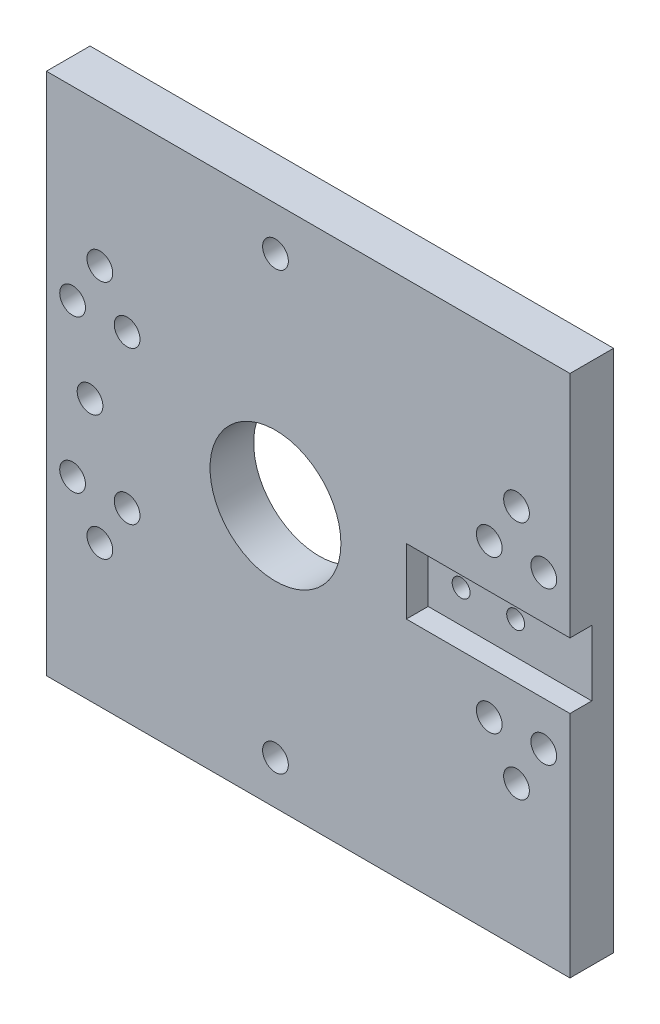
ISO-10303-21;
HEADER;
FILE_DESCRIPTION(('STEP AP214'),'2;1');
FILE_NAME('part.step','',(''),(''),'','','');
FILE_SCHEMA(('AUTOMOTIVE_DESIGN { 1 0 10303 214 1 1 1 1 }'));
ENDSEC;
DATA;
#1=APPLICATION_CONTEXT('core data for automotive mechanical design processes');
#2=APPLICATION_PROTOCOL_DEFINITION('international standard','automotive_design',2000,#1);
#3=PRODUCT_CONTEXT('',#1,'mechanical');
#4=PRODUCT('Part','Part','',(#3));
#5=PRODUCT_RELATED_PRODUCT_CATEGORY('part','',(#4));
#6=PRODUCT_DEFINITION_FORMATION('','',#4);
#7=PRODUCT_DEFINITION_CONTEXT('part definition',#1,'design');
#8=PRODUCT_DEFINITION('design','',#6,#7);
#9=PRODUCT_DEFINITION_SHAPE('','',#8);
#10=(LENGTH_UNIT() NAMED_UNIT(*) SI_UNIT(.MILLI.,.METRE.));
#11=(NAMED_UNIT(*) PLANE_ANGLE_UNIT() SI_UNIT($,.RADIAN.));
#12=(NAMED_UNIT(*) SI_UNIT($,.STERADIAN.) SOLID_ANGLE_UNIT());
#13=UNCERTAINTY_MEASURE_WITH_UNIT(LENGTH_MEASURE(1.E-05),#10,'distance_accuracy_value','');
#14=(GEOMETRIC_REPRESENTATION_CONTEXT(3) GLOBAL_UNCERTAINTY_ASSIGNED_CONTEXT((#13)) GLOBAL_UNIT_ASSIGNED_CONTEXT((#10,
#11,#12)) REPRESENTATION_CONTEXT('',''));
#15=CARTESIAN_POINT('',(0.,0.,0.));
#16=DIRECTION('',(0.,0.,1.));
#17=DIRECTION('',(1.,0.,0.));
#18=AXIS2_PLACEMENT_3D('',#15,#16,#17);
#19=CARTESIAN_POINT('',(67.5,0.,5.));
#20=DIRECTION('',(1.,0.,0.));
#21=DIRECTION('',(0.,0.,-1.));
#22=AXIS2_PLACEMENT_3D('',#19,#20,#21);
#23=PLANE('',#22);
#24=DIRECTION('',(0.,0.,-1.));
#25=VECTOR('',#24,1.);
#26=CARTESIAN_POINT('',(67.5,-60.,5.));
#27=LINE('',#26,#25);
#28=CARTESIAN_POINT('',(67.5,-60.,10.));
#29=VERTEX_POINT('',#28);
#30=CARTESIAN_POINT('',(67.5,-60.,0.));
#31=VERTEX_POINT('',#30);
#32=EDGE_CURVE('E157',#29,#31,#27,.T.);
#33=ORIENTED_EDGE('',*,*,#32,.T.);
#34=DIRECTION('',(0.,-1.,0.));
#35=VECTOR('',#34,1.);
#36=CARTESIAN_POINT('',(67.5,0.,0.));
#37=LINE('',#36,#35);
#38=CARTESIAN_POINT('',(67.5,60.,0.));
#39=VERTEX_POINT('',#38);
#40=EDGE_CURVE('E54',#39,#31,#37,.T.);
#41=ORIENTED_EDGE('',*,*,#40,.F.);
#42=DIRECTION('',(0.,0.,-1.));
#43=VECTOR('',#42,1.);
#44=CARTESIAN_POINT('',(67.5,60.,5.));
#45=LINE('',#44,#43);
#46=CARTESIAN_POINT('',(67.5,60.,10.));
#47=VERTEX_POINT('',#46);
#48=EDGE_CURVE('E12',#47,#39,#45,.T.);
#49=ORIENTED_EDGE('',*,*,#48,.F.);
#50=DIRECTION('',(0.,-1.,0.));
#51=VECTOR('',#50,1.);
#52=CARTESIAN_POINT('',(67.5,0.,10.));
#53=LINE('',#52,#51);
#54=CARTESIAN_POINT('',(67.5,7.5,10.));
#55=VERTEX_POINT('',#54);
#56=EDGE_CURVE('E106',#47,#55,#53,.T.);
#57=ORIENTED_EDGE('',*,*,#56,.T.);
#58=DIRECTION('',(0.,0.,-1.));
#59=VECTOR('',#58,1.);
#60=CARTESIAN_POINT('',(67.5,7.5,184.705627484771));
#61=LINE('',#60,#59);
#62=CARTESIAN_POINT('',(67.5,7.5,5.));
#63=VERTEX_POINT('',#62);
#64=EDGE_CURVE('E127',#55,#63,#61,.T.);
#65=ORIENTED_EDGE('',*,*,#64,.T.);
#66=DIRECTION('',(0.,-1.,0.));
#67=VECTOR('',#66,1.);
#68=CARTESIAN_POINT('',(67.5,0.,5.));
#69=LINE('',#68,#67);
#70=CARTESIAN_POINT('',(67.5,-7.5,5.));
#71=VERTEX_POINT('',#70);
#72=EDGE_CURVE('E147',#63,#71,#69,.T.);
#73=ORIENTED_EDGE('',*,*,#72,.T.);
#74=DIRECTION('',(0.,0.,-1.));
#75=VECTOR('',#74,1.);
#76=CARTESIAN_POINT('',(67.5,-7.5,184.705627484771));
#77=LINE('',#76,#75);
#78=CARTESIAN_POINT('',(67.5,-7.5,10.));
#79=VERTEX_POINT('',#78);
#80=EDGE_CURVE('E120',#79,#71,#77,.T.);
#81=ORIENTED_EDGE('',*,*,#80,.F.);
#82=DIRECTION('',(0.,-1.,0.));
#83=VECTOR('',#82,1.);
#84=CARTESIAN_POINT('',(67.5,0.,10.));
#85=LINE('',#84,#83);
#86=EDGE_CURVE('E183',#79,#29,#85,.T.);
#87=ORIENTED_EDGE('',*,*,#86,.T.);
#88=EDGE_LOOP('',(#33,#41,#49,#57,#65,#73,#81,#87));
#89=FACE_BOUND('',#88,.T.);
#90=ADVANCED_FACE('F40',(#89),#23,.T.);
#91=CARTESIAN_POINT('',(0.,60.,5.));
#92=DIRECTION('',(0.,1.,0.));
#93=DIRECTION('',(0.,0.,1.));
#94=AXIS2_PLACEMENT_3D('',#91,#92,#93);
#95=PLANE('',#94);
#96=DIRECTION('',(1.,0.,0.));
#97=VECTOR('',#96,1.);
#98=CARTESIAN_POINT('',(0.,60.,0.));
#99=LINE('',#98,#97);
#100=CARTESIAN_POINT('',(-52.5,60.,0.));
#101=VERTEX_POINT('',#100);
#102=EDGE_CURVE('E159',#101,#39,#99,.T.);
#103=ORIENTED_EDGE('',*,*,#102,.F.);
#104=DIRECTION('',(0.,0.,-1.));
#105=VECTOR('',#104,1.);
#106=CARTESIAN_POINT('',(-52.5,60.,5.));
#107=LINE('',#106,#105);
#108=CARTESIAN_POINT('',(-52.5,60.,10.));
#109=VERTEX_POINT('',#108);
#110=EDGE_CURVE('E47',#109,#101,#107,.T.);
#111=ORIENTED_EDGE('',*,*,#110,.F.);
#112=DIRECTION('',(1.,0.,0.));
#113=VECTOR('',#112,1.);
#114=CARTESIAN_POINT('',(0.,60.,10.));
#115=LINE('',#114,#113);
#116=EDGE_CURVE('E114',#109,#47,#115,.T.);
#117=ORIENTED_EDGE('',*,*,#116,.T.);
#118=ORIENTED_EDGE('',*,*,#48,.T.);
#119=EDGE_LOOP('',(#103,#111,#117,#118));
#120=FACE_BOUND('',#119,.T.);
#121=ADVANCED_FACE('F122',(#120),#95,.T.);
#122=CARTESIAN_POINT('',(-52.5,0.,5.));
#123=DIRECTION('',(1.,0.,0.));
#124=DIRECTION('',(0.,0.,-1.));
#125=AXIS2_PLACEMENT_3D('',#122,#123,#124);
#126=PLANE('',#125);
#127=DIRECTION('',(0.,-1.,0.));
#128=VECTOR('',#127,1.);
#129=CARTESIAN_POINT('',(-52.5,0.,0.));
#130=LINE('',#129,#128);
#131=CARTESIAN_POINT('',(-52.5,-60.,0.));
#132=VERTEX_POINT('',#131);
#133=EDGE_CURVE('E62',#101,#132,#130,.T.);
#134=ORIENTED_EDGE('',*,*,#133,.T.);
#135=DIRECTION('',(0.,0.,-1.));
#136=VECTOR('',#135,1.);
#137=CARTESIAN_POINT('',(-52.5,-60.,5.));
#138=LINE('',#137,#136);
#139=CARTESIAN_POINT('',(-52.5,-60.,10.));
#140=VERTEX_POINT('',#139);
#141=EDGE_CURVE('E174',#140,#132,#138,.T.);
#142=ORIENTED_EDGE('',*,*,#141,.F.);
#143=DIRECTION('',(0.,-1.,0.));
#144=VECTOR('',#143,1.);
#145=CARTESIAN_POINT('',(-52.5,0.,10.));
#146=LINE('',#145,#144);
#147=EDGE_CURVE('E124',#109,#140,#146,.T.);
#148=ORIENTED_EDGE('',*,*,#147,.F.);
#149=ORIENTED_EDGE('',*,*,#110,.T.);
#150=EDGE_LOOP('',(#134,#142,#148,#149));
#151=FACE_BOUND('',#150,.T.);
#152=ADVANCED_FACE('F175',(#151),#126,.F.);
#153=CARTESIAN_POINT('',(50.05,0.,5.));
#154=DIRECTION('',(0.,0.,-1.));
#155=DIRECTION('',(-1.,0.,0.));
#156=AXIS2_PLACEMENT_3D('',#153,#154,#155);
#157=CYLINDRICAL_SURFACE('',#156,2.04999999999999);
#158=CARTESIAN_POINT('',(50.05,0.,5.));
#159=DIRECTION('',(0.,0.,1.));
#160=DIRECTION('',(1.,0.,0.));
#161=AXIS2_PLACEMENT_3D('',#158,#159,#160);
#162=CIRCLE('',#161,2.04999999999999);
#163=CARTESIAN_POINT('',(52.1,0.,5.));
#164=VERTEX_POINT('',#163);
#165=EDGE_CURVE('E150',#164,#164,#162,.T.);
#166=ORIENTED_EDGE('',*,*,#165,.T.);
#167=EDGE_LOOP('',(#166));
#168=FACE_BOUND('',#167,.T.);
#169=CARTESIAN_POINT('',(50.05,0.,0.));
#170=DIRECTION('',(0.,0.,1.));
#171=DIRECTION('',(1.,0.,0.));
#172=AXIS2_PLACEMENT_3D('',#169,#170,#171);
#173=CIRCLE('',#172,2.04999999999999);
#174=CARTESIAN_POINT('',(52.1,0.,0.));
#175=VERTEX_POINT('',#174);
#176=EDGE_CURVE('E168',#175,#175,#173,.T.);
#177=ORIENTED_EDGE('',*,*,#176,.F.);
#178=EDGE_LOOP('',(#177));
#179=FACE_BOUND('',#178,.T.);
#180=ADVANCED_FACE('F307',(#168,#179),#157,.F.);
#181=CARTESIAN_POINT('',(0.,0.,5.));
#182=DIRECTION('',(0.,0.,-1.));
#183=DIRECTION('',(-1.,0.,0.));
#184=AXIS2_PLACEMENT_3D('',#181,#182,#183);
#185=CYLINDRICAL_SURFACE('',#184,15.);
#186=CARTESIAN_POINT('',(0.,0.,0.));
#187=DIRECTION('',(0.,0.,1.));
#188=DIRECTION('',(1.,0.,0.));
#189=AXIS2_PLACEMENT_3D('',#186,#187,#188);
#190=CIRCLE('',#189,15.);
#191=CARTESIAN_POINT('',(15.,0.,0.));
#192=VERTEX_POINT('',#191);
#193=EDGE_CURVE('E165',#192,#192,#190,.T.);
#194=ORIENTED_EDGE('',*,*,#193,.F.);
#195=EDGE_LOOP('',(#194));
#196=FACE_BOUND('',#195,.T.);
#197=CARTESIAN_POINT('',(0.,0.,10.));
#198=DIRECTION('',(0.,0.,1.));
#199=DIRECTION('',(1.,0.,0.));
#200=AXIS2_PLACEMENT_3D('',#197,#198,#199);
#201=CIRCLE('',#200,15.);
#202=CARTESIAN_POINT('',(15.,0.,10.));
#203=VERTEX_POINT('',#202);
#204=EDGE_CURVE('E123',#203,#203,#201,.T.);
#205=ORIENTED_EDGE('',*,*,#204,.T.);
#206=EDGE_LOOP('',(#205));
#207=FACE_BOUND('',#206,.T.);
#208=ADVANCED_FACE('F305',(#196,#207),#185,.F.);
#209=CARTESIAN_POINT('',(0.,-60.,5.));
#210=DIRECTION('',(0.,1.,0.));
#211=DIRECTION('',(0.,0.,1.));
#212=AXIS2_PLACEMENT_3D('',#209,#210,#211);
#213=PLANE('',#212);
#214=DIRECTION('',(1.,0.,0.));
#215=VECTOR('',#214,1.);
#216=CARTESIAN_POINT('',(0.,-60.,0.));
#217=LINE('',#216,#215);
#218=EDGE_CURVE('E162',#132,#31,#217,.T.);
#219=ORIENTED_EDGE('',*,*,#218,.T.);
#220=ORIENTED_EDGE('',*,*,#32,.F.);
#221=DIRECTION('',(1.,0.,0.));
#222=VECTOR('',#221,1.);
#223=CARTESIAN_POINT('',(0.,-60.,10.));
#224=LINE('',#223,#222);
#225=EDGE_CURVE('E129',#140,#29,#224,.T.);
#226=ORIENTED_EDGE('',*,*,#225,.F.);
#227=ORIENTED_EDGE('',*,*,#141,.T.);
#228=EDGE_LOOP('',(#219,#220,#226,#227));
#229=FACE_BOUND('',#228,.T.);
#230=ADVANCED_FACE('F179',(#229),#213,.F.);
#231=CARTESIAN_POINT('',(37.55,0.,5.));
#232=DIRECTION('',(0.,0.,-1.));
#233=DIRECTION('',(-1.,0.,0.));
#234=AXIS2_PLACEMENT_3D('',#231,#232,#233);
#235=CYLINDRICAL_SURFACE('',#234,2.04999999999999);
#236=CARTESIAN_POINT('',(37.55,0.,5.));
#237=DIRECTION('',(0.,0.,1.));
#238=DIRECTION('',(1.,0.,0.));
#239=AXIS2_PLACEMENT_3D('',#236,#237,#238);
#240=CIRCLE('',#239,2.04999999999999);
#241=CARTESIAN_POINT('',(39.6,0.,5.));
#242=VERTEX_POINT('',#241);
#243=EDGE_CURVE('E154',#242,#242,#240,.T.);
#244=ORIENTED_EDGE('',*,*,#243,.T.);
#245=EDGE_LOOP('',(#244));
#246=FACE_BOUND('',#245,.T.);
#247=CARTESIAN_POINT('',(37.55,0.,0.));
#248=DIRECTION('',(0.,0.,1.));
#249=DIRECTION('',(1.,0.,0.));
#250=AXIS2_PLACEMENT_3D('',#247,#248,#249);
#251=CIRCLE('',#250,2.04999999999999);
#252=CARTESIAN_POINT('',(39.6,0.,0.));
#253=VERTEX_POINT('',#252);
#254=EDGE_CURVE('E151',#253,#253,#251,.T.);
#255=ORIENTED_EDGE('',*,*,#254,.F.);
#256=EDGE_LOOP('',(#255));
#257=FACE_BOUND('',#256,.T.);
#258=ADVANCED_FACE('F314',(#246,#257),#235,.F.);
#259=CARTESIAN_POINT('',(0.,0.,5.));
#260=DIRECTION('',(0.,0.,1.));
#261=DIRECTION('',(1.,0.,0.));
#262=AXIS2_PLACEMENT_3D('',#259,#260,#261);
#263=PLANE('',#262);
#264=DIRECTION('',(1.,0.,0.));
#265=VECTOR('',#264,1.);
#266=CARTESIAN_POINT('',(0.,7.5,5.));
#267=LINE('',#266,#265);
#268=CARTESIAN_POINT('',(30.,7.5,5.));
#269=VERTEX_POINT('',#268);
#270=EDGE_CURVE('E145',#269,#63,#267,.T.);
#271=ORIENTED_EDGE('',*,*,#270,.F.);
#272=DIRECTION('',(0.,1.,0.));
#273=VECTOR('',#272,1.);
#274=CARTESIAN_POINT('',(30.,0.,5.));
#275=LINE('',#274,#273);
#276=CARTESIAN_POINT('',(30.,-7.5,5.));
#277=VERTEX_POINT('',#276);
#278=EDGE_CURVE('E143',#277,#269,#275,.T.);
#279=ORIENTED_EDGE('',*,*,#278,.F.);
#280=DIRECTION('',(1.,0.,0.));
#281=VECTOR('',#280,1.);
#282=CARTESIAN_POINT('',(0.,-7.5,5.));
#283=LINE('',#282,#281);
#284=EDGE_CURVE('E119',#277,#71,#283,.T.);
#285=ORIENTED_EDGE('',*,*,#284,.T.);
#286=ORIENTED_EDGE('',*,*,#72,.F.);
#287=EDGE_LOOP('',(#271,#279,#285,#286));
#288=FACE_BOUND('',#287,.T.);
#289=ORIENTED_EDGE('',*,*,#165,.F.);
#290=EDGE_LOOP('',(#289));
#291=FACE_BOUND('',#290,.T.);
#292=ORIENTED_EDGE('',*,*,#243,.F.);
#293=EDGE_LOOP('',(#292));
#294=FACE_BOUND('',#293,.T.);
#295=ADVANCED_FACE('F344',(#288,#291,#294),#263,.T.);
#296=CARTESIAN_POINT('',(0.,0.,0.));
#297=DIRECTION('',(0.,0.,1.));
#298=DIRECTION('',(1.,0.,0.));
#299=AXIS2_PLACEMENT_3D('',#296,#297,#298);
#300=PLANE('',#299);
#301=CARTESIAN_POINT('',(55.25,27.5,0.));
#302=DIRECTION('',(0.,0.,1.));
#303=DIRECTION('',(1.,0.,0.));
#304=AXIS2_PLACEMENT_3D('',#301,#302,#303);
#305=CIRCLE('',#304,2.95);
#306=CARTESIAN_POINT('',(58.2,27.5,0.));
#307=VERTEX_POINT('',#306);
#308=EDGE_CURVE('E244',#307,#307,#305,.T.);
#309=ORIENTED_EDGE('',*,*,#308,.T.);
#310=EDGE_LOOP('',(#309));
#311=FACE_BOUND('',#310,.T.);
#312=CARTESIAN_POINT('',(61.5,17.5,0.));
#313=DIRECTION('',(0.,0.,1.));
#314=DIRECTION('',(1.,0.,0.));
#315=AXIS2_PLACEMENT_3D('',#312,#313,#314);
#316=CIRCLE('',#315,2.95000000000002);
#317=CARTESIAN_POINT('',(64.45,17.5,0.));
#318=VERTEX_POINT('',#317);
#319=EDGE_CURVE('E238',#318,#318,#316,.T.);
#320=ORIENTED_EDGE('',*,*,#319,.T.);
#321=EDGE_LOOP('',(#320));
#322=FACE_BOUND('',#321,.T.);
#323=CARTESIAN_POINT('',(61.5,-17.5,0.));
#324=DIRECTION('',(0.,0.,1.));
#325=DIRECTION('',(-1.,0.,0.));
#326=AXIS2_PLACEMENT_3D('',#323,#324,#325);
#327=CIRCLE('',#326,2.95000000000001);
#328=CARTESIAN_POINT('',(58.55,-17.5,0.));
#329=VERTEX_POINT('',#328);
#330=EDGE_CURVE('E232',#329,#329,#327,.T.);
#331=ORIENTED_EDGE('',*,*,#330,.T.);
#332=EDGE_LOOP('',(#331));
#333=FACE_BOUND('',#332,.T.);
#334=CARTESIAN_POINT('',(55.25,-27.5,0.));
#335=DIRECTION('',(0.,0.,1.));
#336=DIRECTION('',(-1.,0.,0.));
#337=AXIS2_PLACEMENT_3D('',#334,#335,#336);
#338=CIRCLE('',#337,2.95);
#339=CARTESIAN_POINT('',(52.3,-27.5,0.));
#340=VERTEX_POINT('',#339);
#341=EDGE_CURVE('E214',#340,#340,#338,.T.);
#342=ORIENTED_EDGE('',*,*,#341,.T.);
#343=EDGE_LOOP('',(#342));
#344=FACE_BOUND('',#343,.T.);
#345=CARTESIAN_POINT('',(0.,-50.,0.));
#346=DIRECTION('',(0.,0.,1.));
#347=DIRECTION('',(-1.,0.,0.));
#348=AXIS2_PLACEMENT_3D('',#345,#346,#347);
#349=CIRCLE('',#348,2.95);
#350=CARTESIAN_POINT('',(-2.95,-50.,0.));
#351=VERTEX_POINT('',#350);
#352=EDGE_CURVE('E215',#351,#351,#349,.T.);
#353=ORIENTED_EDGE('',*,*,#352,.T.);
#354=EDGE_LOOP('',(#353));
#355=FACE_BOUND('',#354,.T.);
#356=CARTESIAN_POINT('',(0.,50.,0.));
#357=DIRECTION('',(0.,0.,1.));
#358=DIRECTION('',(1.,0.,0.));
#359=AXIS2_PLACEMENT_3D('',#356,#357,#358);
#360=CIRCLE('',#359,2.95);
#361=CARTESIAN_POINT('',(2.95,50.,0.));
#362=VERTEX_POINT('',#361);
#363=EDGE_CURVE('E222',#362,#362,#360,.T.);
#364=ORIENTED_EDGE('',*,*,#363,.T.);
#365=EDGE_LOOP('',(#364));
#366=FACE_BOUND('',#365,.T.);
#367=CARTESIAN_POINT('',(-42.5,0.,0.));
#368=DIRECTION('',(0.,0.,1.));
#369=DIRECTION('',(1.,0.,0.));
#370=AXIS2_PLACEMENT_3D('',#367,#368,#369);
#371=CIRCLE('',#370,2.95);
#372=CARTESIAN_POINT('',(-39.55,0.,0.));
#373=VERTEX_POINT('',#372);
#374=EDGE_CURVE('E201',#373,#373,#371,.T.);
#375=ORIENTED_EDGE('',*,*,#374,.T.);
#376=EDGE_LOOP('',(#375));
#377=FACE_BOUND('',#376,.T.);
#378=CARTESIAN_POINT('',(49.,-17.5,0.));
#379=DIRECTION('',(0.,0.,1.));
#380=DIRECTION('',(-1.,0.,0.));
#381=AXIS2_PLACEMENT_3D('',#378,#379,#380);
#382=CIRCLE('',#381,2.95);
#383=CARTESIAN_POINT('',(46.05,-17.5,0.));
#384=VERTEX_POINT('',#383);
#385=EDGE_CURVE('E208',#384,#384,#382,.T.);
#386=ORIENTED_EDGE('',*,*,#385,.T.);
#387=EDGE_LOOP('',(#386));
#388=FACE_BOUND('',#387,.T.);
#389=CARTESIAN_POINT('',(-40.25,27.5,0.));
#390=DIRECTION('',(0.,0.,1.));
#391=DIRECTION('',(-1.,0.,0.));
#392=AXIS2_PLACEMENT_3D('',#389,#390,#391);
#393=CIRCLE('',#392,2.95);
#394=CARTESIAN_POINT('',(-43.2,27.5,0.));
#395=VERTEX_POINT('',#394);
#396=EDGE_CURVE('E273',#395,#395,#393,.T.);
#397=ORIENTED_EDGE('',*,*,#396,.T.);
#398=EDGE_LOOP('',(#397));
#399=FACE_BOUND('',#398,.T.);
#400=CARTESIAN_POINT('',(-46.5,17.5,0.));
#401=DIRECTION('',(0.,0.,1.));
#402=DIRECTION('',(-1.,0.,0.));
#403=AXIS2_PLACEMENT_3D('',#400,#401,#402);
#404=CIRCLE('',#403,2.95000000000001);
#405=CARTESIAN_POINT('',(-49.45,17.5,0.));
#406=VERTEX_POINT('',#405);
#407=EDGE_CURVE('E279',#406,#406,#404,.T.);
#408=ORIENTED_EDGE('',*,*,#407,.T.);
#409=EDGE_LOOP('',(#408));
#410=FACE_BOUND('',#409,.T.);
#411=CARTESIAN_POINT('',(-34.,17.5,0.));
#412=DIRECTION('',(0.,0.,1.));
#413=DIRECTION('',(-1.,0.,0.));
#414=AXIS2_PLACEMENT_3D('',#411,#412,#413);
#415=CIRCLE('',#414,2.95);
#416=CARTESIAN_POINT('',(-36.95,17.5,0.));
#417=VERTEX_POINT('',#416);
#418=EDGE_CURVE('E249',#417,#417,#415,.T.);
#419=ORIENTED_EDGE('',*,*,#418,.T.);
#420=EDGE_LOOP('',(#419));
#421=FACE_BOUND('',#420,.T.);
#422=CARTESIAN_POINT('',(-34.,-17.5,0.));
#423=DIRECTION('',(0.,0.,1.));
#424=DIRECTION('',(1.,0.,0.));
#425=AXIS2_PLACEMENT_3D('',#422,#423,#424);
#426=CIRCLE('',#425,2.95);
#427=CARTESIAN_POINT('',(-31.05,-17.5,0.));
#428=VERTEX_POINT('',#427);
#429=EDGE_CURVE('E256',#428,#428,#426,.T.);
#430=ORIENTED_EDGE('',*,*,#429,.T.);
#431=EDGE_LOOP('',(#430));
#432=FACE_BOUND('',#431,.T.);
#433=CARTESIAN_POINT('',(-46.5,-17.5,0.));
#434=DIRECTION('',(0.,0.,1.));
#435=DIRECTION('',(1.,0.,0.));
#436=AXIS2_PLACEMENT_3D('',#433,#434,#435);
#437=CIRCLE('',#436,2.95000000000001);
#438=CARTESIAN_POINT('',(-43.55,-17.5,0.));
#439=VERTEX_POINT('',#438);
#440=EDGE_CURVE('E262',#439,#439,#437,.T.);
#441=ORIENTED_EDGE('',*,*,#440,.T.);
#442=EDGE_LOOP('',(#441));
#443=FACE_BOUND('',#442,.T.);
#444=CARTESIAN_POINT('',(-40.25,-27.5,0.));
#445=DIRECTION('',(0.,0.,1.));
#446=DIRECTION('',(1.,0.,0.));
#447=AXIS2_PLACEMENT_3D('',#444,#445,#446);
#448=CIRCLE('',#447,2.95);
#449=CARTESIAN_POINT('',(-37.3,-27.5,0.));
#450=VERTEX_POINT('',#449);
#451=EDGE_CURVE('E268',#450,#450,#448,.T.);
#452=ORIENTED_EDGE('',*,*,#451,.T.);
#453=EDGE_LOOP('',(#452));
#454=FACE_BOUND('',#453,.T.);
#455=CARTESIAN_POINT('',(49.,17.5,0.));
#456=DIRECTION('',(0.,0.,1.));
#457=DIRECTION('',(1.,0.,0.));
#458=AXIS2_PLACEMENT_3D('',#455,#456,#457);
#459=CIRCLE('',#458,2.95);
#460=CARTESIAN_POINT('',(51.95,17.5,0.));
#461=VERTEX_POINT('',#460);
#462=EDGE_CURVE('E194',#461,#461,#459,.T.);
#463=ORIENTED_EDGE('',*,*,#462,.T.);
#464=EDGE_LOOP('',(#463));
#465=FACE_BOUND('',#464,.T.);
#466=ORIENTED_EDGE('',*,*,#40,.T.);
#467=ORIENTED_EDGE('',*,*,#218,.F.);
#468=ORIENTED_EDGE('',*,*,#133,.F.);
#469=ORIENTED_EDGE('',*,*,#102,.T.);
#470=EDGE_LOOP('',(#466,#467,#468,#469));
#471=FACE_BOUND('',#470,.T.);
#472=ORIENTED_EDGE('',*,*,#176,.T.);
#473=EDGE_LOOP('',(#472));
#474=FACE_BOUND('',#473,.T.);
#475=ORIENTED_EDGE('',*,*,#254,.T.);
#476=EDGE_LOOP('',(#475));
#477=FACE_BOUND('',#476,.T.);
#478=ORIENTED_EDGE('',*,*,#193,.T.);
#479=EDGE_LOOP('',(#478));
#480=FACE_BOUND('',#479,.T.);
#481=ADVANCED_FACE('F176',(#311,#322,#333,#344,#355,#366,#377,#388,#399,#410,#421,#432,#443,
#454,#465,#471,#474,#477,#480),#300,.F.);
#482=CARTESIAN_POINT('',(0.,7.5,184.705627484771));
#483=DIRECTION('',(0.,-1.,0.));
#484=DIRECTION('',(1.,0.,0.));
#485=AXIS2_PLACEMENT_3D('',#482,#483,#484);
#486=PLANE('',#485);
#487=DIRECTION('',(0.,0.,-1.));
#488=VECTOR('',#487,1.);
#489=CARTESIAN_POINT('',(30.,7.5,184.705627484771));
#490=LINE('',#489,#488);
#491=CARTESIAN_POINT('',(30.,7.5,10.));
#492=VERTEX_POINT('',#491);
#493=EDGE_CURVE('E134',#492,#269,#490,.T.);
#494=ORIENTED_EDGE('',*,*,#493,.T.);
#495=ORIENTED_EDGE('',*,*,#270,.T.);
#496=ORIENTED_EDGE('',*,*,#64,.F.);
#497=DIRECTION('',(-1.,0.,0.));
#498=VECTOR('',#497,1.);
#499=CARTESIAN_POINT('',(0.,7.5,10.));
#500=LINE('',#499,#498);
#501=EDGE_CURVE('E117',#55,#492,#500,.T.);
#502=ORIENTED_EDGE('',*,*,#501,.T.);
#503=EDGE_LOOP('',(#494,#495,#496,#502));
#504=FACE_BOUND('',#503,.T.);
#505=ADVANCED_FACE('F390',(#504),#486,.T.);
#506=CARTESIAN_POINT('',(30.,0.,184.705627484771));
#507=DIRECTION('',(1.,0.,0.));
#508=DIRECTION('',(0.,1.,0.));
#509=AXIS2_PLACEMENT_3D('',#506,#507,#508);
#510=PLANE('',#509);
#511=DIRECTION('',(0.,0.,-1.));
#512=VECTOR('',#511,1.);
#513=CARTESIAN_POINT('',(30.,-7.5,184.705627484771));
#514=LINE('',#513,#512);
#515=CARTESIAN_POINT('',(30.,-7.5,10.));
#516=VERTEX_POINT('',#515);
#517=EDGE_CURVE('E137',#516,#277,#514,.T.);
#518=ORIENTED_EDGE('',*,*,#517,.T.);
#519=ORIENTED_EDGE('',*,*,#278,.T.);
#520=ORIENTED_EDGE('',*,*,#493,.F.);
#521=DIRECTION('',(0.,-1.,0.));
#522=VECTOR('',#521,1.);
#523=CARTESIAN_POINT('',(30.,0.,10.));
#524=LINE('',#523,#522);
#525=EDGE_CURVE('E188',#492,#516,#524,.T.);
#526=ORIENTED_EDGE('',*,*,#525,.T.);
#527=EDGE_LOOP('',(#518,#519,#520,#526));
#528=FACE_BOUND('',#527,.T.);
#529=ADVANCED_FACE('F397',(#528),#510,.T.);
#530=CARTESIAN_POINT('',(0.,-7.5,184.705627484771));
#531=DIRECTION('',(0.,-1.,0.));
#532=DIRECTION('',(1.,0.,0.));
#533=AXIS2_PLACEMENT_3D('',#530,#531,#532);
#534=PLANE('',#533);
#535=ORIENTED_EDGE('',*,*,#284,.F.);
#536=ORIENTED_EDGE('',*,*,#517,.F.);
#537=DIRECTION('',(-1.,0.,0.));
#538=VECTOR('',#537,1.);
#539=CARTESIAN_POINT('',(0.,-7.5,10.));
#540=LINE('',#539,#538);
#541=EDGE_CURVE('E186',#79,#516,#540,.T.);
#542=ORIENTED_EDGE('',*,*,#541,.F.);
#543=ORIENTED_EDGE('',*,*,#80,.T.);
#544=EDGE_LOOP('',(#535,#536,#542,#543));
#545=FACE_BOUND('',#544,.T.);
#546=ADVANCED_FACE('F290',(#545),#534,.F.);
#547=CARTESIAN_POINT('',(0.,0.,10.));
#548=DIRECTION('',(0.,0.,1.));
#549=DIRECTION('',(1.,0.,0.));
#550=AXIS2_PLACEMENT_3D('',#547,#548,#549);
#551=PLANE('',#550);
#552=CARTESIAN_POINT('',(55.25,27.5,10.));
#553=DIRECTION('',(0.,0.,1.));
#554=DIRECTION('',(1.,0.,0.));
#555=AXIS2_PLACEMENT_3D('',#552,#553,#554);
#556=CIRCLE('',#555,2.95);
#557=CARTESIAN_POINT('',(58.2,27.5,10.));
#558=VERTEX_POINT('',#557);
#559=EDGE_CURVE('E198',#558,#558,#556,.T.);
#560=ORIENTED_EDGE('',*,*,#559,.F.);
#561=EDGE_LOOP('',(#560));
#562=FACE_BOUND('',#561,.T.);
#563=CARTESIAN_POINT('',(61.5,17.5,10.));
#564=DIRECTION('',(0.,0.,1.));
#565=DIRECTION('',(1.,0.,0.));
#566=AXIS2_PLACEMENT_3D('',#563,#564,#565);
#567=CIRCLE('',#566,2.95000000000002);
#568=CARTESIAN_POINT('',(64.45,17.5,10.));
#569=VERTEX_POINT('',#568);
#570=EDGE_CURVE('E241',#569,#569,#567,.T.);
#571=ORIENTED_EDGE('',*,*,#570,.F.);
#572=EDGE_LOOP('',(#571));
#573=FACE_BOUND('',#572,.T.);
#574=CARTESIAN_POINT('',(61.5,-17.5,10.));
#575=DIRECTION('',(0.,0.,1.));
#576=DIRECTION('',(-1.,0.,0.));
#577=AXIS2_PLACEMENT_3D('',#574,#575,#576);
#578=CIRCLE('',#577,2.95000000000001);
#579=CARTESIAN_POINT('',(58.55,-17.5,10.));
#580=VERTEX_POINT('',#579);
#581=EDGE_CURVE('E235',#580,#580,#578,.T.);
#582=ORIENTED_EDGE('',*,*,#581,.F.);
#583=EDGE_LOOP('',(#582));
#584=FACE_BOUND('',#583,.T.);
#585=CARTESIAN_POINT('',(55.25,-27.5,10.));
#586=DIRECTION('',(0.,0.,1.));
#587=DIRECTION('',(-1.,0.,0.));
#588=AXIS2_PLACEMENT_3D('',#585,#586,#587);
#589=CIRCLE('',#588,2.95);
#590=CARTESIAN_POINT('',(52.3,-27.5,10.));
#591=VERTEX_POINT('',#590);
#592=EDGE_CURVE('E229',#591,#591,#589,.T.);
#593=ORIENTED_EDGE('',*,*,#592,.F.);
#594=EDGE_LOOP('',(#593));
#595=FACE_BOUND('',#594,.T.);
#596=CARTESIAN_POINT('',(0.,-50.,10.));
#597=DIRECTION('',(0.,0.,1.));
#598=DIRECTION('',(-1.,0.,0.));
#599=AXIS2_PLACEMENT_3D('',#596,#597,#598);
#600=CIRCLE('',#599,2.95);
#601=CARTESIAN_POINT('',(-2.95,-50.,10.));
#602=VERTEX_POINT('',#601);
#603=EDGE_CURVE('E218',#602,#602,#600,.T.);
#604=ORIENTED_EDGE('',*,*,#603,.F.);
#605=EDGE_LOOP('',(#604));
#606=FACE_BOUND('',#605,.T.);
#607=CARTESIAN_POINT('',(0.,50.,10.));
#608=DIRECTION('',(0.,0.,1.));
#609=DIRECTION('',(1.,0.,0.));
#610=AXIS2_PLACEMENT_3D('',#607,#608,#609);
#611=CIRCLE('',#610,2.95);
#612=CARTESIAN_POINT('',(2.95,50.,10.));
#613=VERTEX_POINT('',#612);
#614=EDGE_CURVE('E205',#613,#613,#611,.T.);
#615=ORIENTED_EDGE('',*,*,#614,.F.);
#616=EDGE_LOOP('',(#615));
#617=FACE_BOUND('',#616,.T.);
#618=CARTESIAN_POINT('',(-42.5,0.,10.));
#619=DIRECTION('',(0.,0.,1.));
#620=DIRECTION('',(1.,0.,0.));
#621=AXIS2_PLACEMENT_3D('',#618,#619,#620);
#622=CIRCLE('',#621,2.95);
#623=CARTESIAN_POINT('',(-39.55,0.,10.));
#624=VERTEX_POINT('',#623);
#625=EDGE_CURVE('E204',#624,#624,#622,.T.);
#626=ORIENTED_EDGE('',*,*,#625,.F.);
#627=EDGE_LOOP('',(#626));
#628=FACE_BOUND('',#627,.T.);
#629=CARTESIAN_POINT('',(49.,-17.5,10.));
#630=DIRECTION('',(0.,0.,1.));
#631=DIRECTION('',(-1.,0.,0.));
#632=AXIS2_PLACEMENT_3D('',#629,#630,#631);
#633=CIRCLE('',#632,2.95);
#634=CARTESIAN_POINT('',(46.05,-17.5,10.));
#635=VERTEX_POINT('',#634);
#636=EDGE_CURVE('E211',#635,#635,#633,.T.);
#637=ORIENTED_EDGE('',*,*,#636,.F.);
#638=EDGE_LOOP('',(#637));
#639=FACE_BOUND('',#638,.T.);
#640=CARTESIAN_POINT('',(-40.25,27.5,10.));
#641=DIRECTION('',(0.,0.,1.));
#642=DIRECTION('',(-1.,0.,0.));
#643=AXIS2_PLACEMENT_3D('',#640,#641,#642);
#644=CIRCLE('',#643,2.95);
#645=CARTESIAN_POINT('',(-43.2,27.5,10.));
#646=VERTEX_POINT('',#645);
#647=EDGE_CURVE('E276',#646,#646,#644,.T.);
#648=ORIENTED_EDGE('',*,*,#647,.F.);
#649=EDGE_LOOP('',(#648));
#650=FACE_BOUND('',#649,.T.);
#651=CARTESIAN_POINT('',(-46.5,17.5,10.));
#652=DIRECTION('',(0.,0.,1.));
#653=DIRECTION('',(-1.,0.,0.));
#654=AXIS2_PLACEMENT_3D('',#651,#652,#653);
#655=CIRCLE('',#654,2.95000000000001);
#656=CARTESIAN_POINT('',(-49.45,17.5,10.));
#657=VERTEX_POINT('',#656);
#658=EDGE_CURVE('E253',#657,#657,#655,.T.);
#659=ORIENTED_EDGE('',*,*,#658,.F.);
#660=EDGE_LOOP('',(#659));
#661=FACE_BOUND('',#660,.T.);
#662=CARTESIAN_POINT('',(-34.,17.5,10.));
#663=DIRECTION('',(0.,0.,1.));
#664=DIRECTION('',(-1.,0.,0.));
#665=AXIS2_PLACEMENT_3D('',#662,#663,#664);
#666=CIRCLE('',#665,2.95);
#667=CARTESIAN_POINT('',(-36.95,17.5,10.));
#668=VERTEX_POINT('',#667);
#669=EDGE_CURVE('E252',#668,#668,#666,.T.);
#670=ORIENTED_EDGE('',*,*,#669,.F.);
#671=EDGE_LOOP('',(#670));
#672=FACE_BOUND('',#671,.T.);
#673=CARTESIAN_POINT('',(-34.,-17.5,10.));
#674=DIRECTION('',(0.,0.,1.));
#675=DIRECTION('',(1.,0.,0.));
#676=AXIS2_PLACEMENT_3D('',#673,#674,#675);
#677=CIRCLE('',#676,2.95);
#678=CARTESIAN_POINT('',(-31.05,-17.5,10.));
#679=VERTEX_POINT('',#678);
#680=EDGE_CURVE('E259',#679,#679,#677,.T.);
#681=ORIENTED_EDGE('',*,*,#680,.F.);
#682=EDGE_LOOP('',(#681));
#683=FACE_BOUND('',#682,.T.);
#684=CARTESIAN_POINT('',(-46.5,-17.5,10.));
#685=DIRECTION('',(0.,0.,1.));
#686=DIRECTION('',(1.,0.,0.));
#687=AXIS2_PLACEMENT_3D('',#684,#685,#686);
#688=CIRCLE('',#687,2.95000000000001);
#689=CARTESIAN_POINT('',(-43.55,-17.5,10.));
#690=VERTEX_POINT('',#689);
#691=EDGE_CURVE('E265',#690,#690,#688,.T.);
#692=ORIENTED_EDGE('',*,*,#691,.F.);
#693=EDGE_LOOP('',(#692));
#694=FACE_BOUND('',#693,.T.);
#695=CARTESIAN_POINT('',(-40.25,-27.5,10.));
#696=DIRECTION('',(0.,0.,1.));
#697=DIRECTION('',(1.,0.,0.));
#698=AXIS2_PLACEMENT_3D('',#695,#696,#697);
#699=CIRCLE('',#698,2.95);
#700=CARTESIAN_POINT('',(-37.3,-27.5,10.));
#701=VERTEX_POINT('',#700);
#702=EDGE_CURVE('E219',#701,#701,#699,.T.);
#703=ORIENTED_EDGE('',*,*,#702,.F.);
#704=EDGE_LOOP('',(#703));
#705=FACE_BOUND('',#704,.T.);
#706=CARTESIAN_POINT('',(49.,17.5,10.));
#707=DIRECTION('',(0.,0.,1.));
#708=DIRECTION('',(1.,0.,0.));
#709=AXIS2_PLACEMENT_3D('',#706,#707,#708);
#710=CIRCLE('',#709,2.95);
#711=CARTESIAN_POINT('',(51.95,17.5,10.));
#712=VERTEX_POINT('',#711);
#713=EDGE_CURVE('E195',#712,#712,#710,.T.);
#714=ORIENTED_EDGE('',*,*,#713,.F.);
#715=EDGE_LOOP('',(#714));
#716=FACE_BOUND('',#715,.T.);
#717=ORIENTED_EDGE('',*,*,#204,.F.);
#718=EDGE_LOOP('',(#717));
#719=FACE_BOUND('',#718,.T.);
#720=ORIENTED_EDGE('',*,*,#116,.F.);
#721=ORIENTED_EDGE('',*,*,#147,.T.);
#722=ORIENTED_EDGE('',*,*,#225,.T.);
#723=ORIENTED_EDGE('',*,*,#86,.F.);
#724=ORIENTED_EDGE('',*,*,#541,.T.);
#725=ORIENTED_EDGE('',*,*,#525,.F.);
#726=ORIENTED_EDGE('',*,*,#501,.F.);
#727=ORIENTED_EDGE('',*,*,#56,.F.);
#728=EDGE_LOOP('',(#720,#721,#722,#723,#724,#725,#726,#727));
#729=FACE_BOUND('',#728,.T.);
#730=ADVANCED_FACE('F112',(#562,#573,#584,#595,#606,#617,#628,#639,#650,#661,#672,#683,#694,
#705,#716,#719,#729),#551,.T.);
#731=CARTESIAN_POINT('',(49.,17.5,0.));
#732=DIRECTION('',(0.,0.,1.));
#733=DIRECTION('',(1.,0.,0.));
#734=AXIS2_PLACEMENT_3D('',#731,#732,#733);
#735=CYLINDRICAL_SURFACE('',#734,2.95);
#736=ORIENTED_EDGE('',*,*,#462,.F.);
#737=EDGE_LOOP('',(#736));
#738=FACE_BOUND('',#737,.T.);
#739=ORIENTED_EDGE('',*,*,#713,.T.);
#740=EDGE_LOOP('',(#739));
#741=FACE_BOUND('',#740,.T.);
#742=ADVANCED_FACE('F289',(#738,#741),#735,.F.);
#743=CARTESIAN_POINT('',(-40.25,-27.5,0.));
#744=DIRECTION('',(0.,0.,1.));
#745=DIRECTION('',(1.,0.,0.));
#746=AXIS2_PLACEMENT_3D('',#743,#744,#745);
#747=CYLINDRICAL_SURFACE('',#746,2.95);
#748=ORIENTED_EDGE('',*,*,#451,.F.);
#749=EDGE_LOOP('',(#748));
#750=FACE_BOUND('',#749,.T.);
#751=ORIENTED_EDGE('',*,*,#702,.T.);
#752=EDGE_LOOP('',(#751));
#753=FACE_BOUND('',#752,.T.);
#754=ADVANCED_FACE('F437',(#750,#753),#747,.F.);
#755=CARTESIAN_POINT('',(-46.5,-17.5,0.));
#756=DIRECTION('',(0.,0.,1.));
#757=DIRECTION('',(1.,0.,0.));
#758=AXIS2_PLACEMENT_3D('',#755,#756,#757);
#759=CYLINDRICAL_SURFACE('',#758,2.95000000000001);
#760=ORIENTED_EDGE('',*,*,#440,.F.);
#761=EDGE_LOOP('',(#760));
#762=FACE_BOUND('',#761,.T.);
#763=ORIENTED_EDGE('',*,*,#691,.T.);
#764=EDGE_LOOP('',(#763));
#765=FACE_BOUND('',#764,.T.);
#766=ADVANCED_FACE('F448',(#762,#765),#759,.F.);
#767=CARTESIAN_POINT('',(-34.,-17.5,0.));
#768=DIRECTION('',(0.,0.,1.));
#769=DIRECTION('',(1.,0.,0.));
#770=AXIS2_PLACEMENT_3D('',#767,#768,#769);
#771=CYLINDRICAL_SURFACE('',#770,2.95);
#772=ORIENTED_EDGE('',*,*,#429,.F.);
#773=EDGE_LOOP('',(#772));
#774=FACE_BOUND('',#773,.T.);
#775=ORIENTED_EDGE('',*,*,#680,.T.);
#776=EDGE_LOOP('',(#775));
#777=FACE_BOUND('',#776,.T.);
#778=ADVANCED_FACE('F459',(#774,#777),#771,.F.);
#779=CARTESIAN_POINT('',(-34.,17.5,0.));
#780=DIRECTION('',(0.,0.,1.));
#781=DIRECTION('',(1.,0.,0.));
#782=AXIS2_PLACEMENT_3D('',#779,#780,#781);
#783=CYLINDRICAL_SURFACE('',#782,2.95);
#784=ORIENTED_EDGE('',*,*,#418,.F.);
#785=EDGE_LOOP('',(#784));
#786=FACE_BOUND('',#785,.T.);
#787=ORIENTED_EDGE('',*,*,#669,.T.);
#788=EDGE_LOOP('',(#787));
#789=FACE_BOUND('',#788,.T.);
#790=ADVANCED_FACE('F470',(#786,#789),#783,.F.);
#791=CARTESIAN_POINT('',(-46.5,17.5,0.));
#792=DIRECTION('',(0.,0.,1.));
#793=DIRECTION('',(1.,0.,0.));
#794=AXIS2_PLACEMENT_3D('',#791,#792,#793);
#795=CYLINDRICAL_SURFACE('',#794,2.95000000000001);
#796=ORIENTED_EDGE('',*,*,#407,.F.);
#797=EDGE_LOOP('',(#796));
#798=FACE_BOUND('',#797,.T.);
#799=ORIENTED_EDGE('',*,*,#658,.T.);
#800=EDGE_LOOP('',(#799));
#801=FACE_BOUND('',#800,.T.);
#802=ADVANCED_FACE('F285',(#798,#801),#795,.F.);
#803=CARTESIAN_POINT('',(-40.25,27.5,0.));
#804=DIRECTION('',(0.,0.,1.));
#805=DIRECTION('',(1.,0.,0.));
#806=AXIS2_PLACEMENT_3D('',#803,#804,#805);
#807=CYLINDRICAL_SURFACE('',#806,2.95);
#808=ORIENTED_EDGE('',*,*,#396,.F.);
#809=EDGE_LOOP('',(#808));
#810=FACE_BOUND('',#809,.T.);
#811=ORIENTED_EDGE('',*,*,#647,.T.);
#812=EDGE_LOOP('',(#811));
#813=FACE_BOUND('',#812,.T.);
#814=ADVANCED_FACE('F491',(#810,#813),#807,.F.);
#815=CARTESIAN_POINT('',(49.,-17.5,0.));
#816=DIRECTION('',(0.,0.,1.));
#817=DIRECTION('',(1.,0.,0.));
#818=AXIS2_PLACEMENT_3D('',#815,#816,#817);
#819=CYLINDRICAL_SURFACE('',#818,2.95);
#820=ORIENTED_EDGE('',*,*,#385,.F.);
#821=EDGE_LOOP('',(#820));
#822=FACE_BOUND('',#821,.T.);
#823=ORIENTED_EDGE('',*,*,#636,.T.);
#824=EDGE_LOOP('',(#823));
#825=FACE_BOUND('',#824,.T.);
#826=ADVANCED_FACE('F502',(#822,#825),#819,.F.);
#827=CARTESIAN_POINT('',(-42.5,0.,0.));
#828=DIRECTION('',(0.,0.,1.));
#829=DIRECTION('',(1.,0.,0.));
#830=AXIS2_PLACEMENT_3D('',#827,#828,#829);
#831=CYLINDRICAL_SURFACE('',#830,2.95);
#832=ORIENTED_EDGE('',*,*,#374,.F.);
#833=EDGE_LOOP('',(#832));
#834=FACE_BOUND('',#833,.T.);
#835=ORIENTED_EDGE('',*,*,#625,.T.);
#836=EDGE_LOOP('',(#835));
#837=FACE_BOUND('',#836,.T.);
#838=ADVANCED_FACE('F513',(#834,#837),#831,.F.);
#839=CARTESIAN_POINT('',(0.,50.,0.));
#840=DIRECTION('',(0.,0.,1.));
#841=DIRECTION('',(1.,0.,0.));
#842=AXIS2_PLACEMENT_3D('',#839,#840,#841);
#843=CYLINDRICAL_SURFACE('',#842,2.95);
#844=ORIENTED_EDGE('',*,*,#363,.F.);
#845=EDGE_LOOP('',(#844));
#846=FACE_BOUND('',#845,.T.);
#847=ORIENTED_EDGE('',*,*,#614,.T.);
#848=EDGE_LOOP('',(#847));
#849=FACE_BOUND('',#848,.T.);
#850=ADVANCED_FACE('F524',(#846,#849),#843,.F.);
#851=CARTESIAN_POINT('',(0.,-50.,0.));
#852=DIRECTION('',(0.,0.,1.));
#853=DIRECTION('',(1.,0.,0.));
#854=AXIS2_PLACEMENT_3D('',#851,#852,#853);
#855=CYLINDRICAL_SURFACE('',#854,2.95);
#856=ORIENTED_EDGE('',*,*,#352,.F.);
#857=EDGE_LOOP('',(#856));
#858=FACE_BOUND('',#857,.T.);
#859=ORIENTED_EDGE('',*,*,#603,.T.);
#860=EDGE_LOOP('',(#859));
#861=FACE_BOUND('',#860,.T.);
#862=ADVANCED_FACE('F535',(#858,#861),#855,.F.);
#863=CARTESIAN_POINT('',(55.25,-27.5,0.));
#864=DIRECTION('',(0.,0.,1.));
#865=DIRECTION('',(1.,0.,0.));
#866=AXIS2_PLACEMENT_3D('',#863,#864,#865);
#867=CYLINDRICAL_SURFACE('',#866,2.95);
#868=ORIENTED_EDGE('',*,*,#341,.F.);
#869=EDGE_LOOP('',(#868));
#870=FACE_BOUND('',#869,.T.);
#871=ORIENTED_EDGE('',*,*,#592,.T.);
#872=EDGE_LOOP('',(#871));
#873=FACE_BOUND('',#872,.T.);
#874=ADVANCED_FACE('F546',(#870,#873),#867,.F.);
#875=CARTESIAN_POINT('',(61.5,-17.5,0.));
#876=DIRECTION('',(0.,0.,1.));
#877=DIRECTION('',(1.,0.,0.));
#878=AXIS2_PLACEMENT_3D('',#875,#876,#877);
#879=CYLINDRICAL_SURFACE('',#878,2.95000000000001);
#880=ORIENTED_EDGE('',*,*,#330,.F.);
#881=EDGE_LOOP('',(#880));
#882=FACE_BOUND('',#881,.T.);
#883=ORIENTED_EDGE('',*,*,#581,.T.);
#884=EDGE_LOOP('',(#883));
#885=FACE_BOUND('',#884,.T.);
#886=ADVANCED_FACE('F557',(#882,#885),#879,.F.);
#887=CARTESIAN_POINT('',(61.5,17.5,0.));
#888=DIRECTION('',(0.,0.,1.));
#889=DIRECTION('',(1.,0.,0.));
#890=AXIS2_PLACEMENT_3D('',#887,#888,#889);
#891=CYLINDRICAL_SURFACE('',#890,2.95000000000002);
#892=ORIENTED_EDGE('',*,*,#319,.F.);
#893=EDGE_LOOP('',(#892));
#894=FACE_BOUND('',#893,.T.);
#895=ORIENTED_EDGE('',*,*,#570,.T.);
#896=EDGE_LOOP('',(#895));
#897=FACE_BOUND('',#896,.T.);
#898=ADVANCED_FACE('F568',(#894,#897),#891,.F.);
#899=CARTESIAN_POINT('',(55.25,27.5,0.));
#900=DIRECTION('',(0.,0.,1.));
#901=DIRECTION('',(1.,0.,0.));
#902=AXIS2_PLACEMENT_3D('',#899,#900,#901);
#903=CYLINDRICAL_SURFACE('',#902,2.95);
#904=ORIENTED_EDGE('',*,*,#308,.F.);
#905=EDGE_LOOP('',(#904));
#906=FACE_BOUND('',#905,.T.);
#907=ORIENTED_EDGE('',*,*,#559,.T.);
#908=EDGE_LOOP('',(#907));
#909=FACE_BOUND('',#908,.T.);
#910=ADVANCED_FACE('F579',(#906,#909),#903,.F.);
#911=CLOSED_SHELL('',(#90,#121,#152,#180,#208,#230,#258,#295,#481,#505,#529,#546,#730,#742,#754,
#766,#778,#790,#802,#814,#826,#838,#850,#862,#874,#886,#898,#910));
#912=MANIFOLD_SOLID_BREP('B2',#911);
#913=ADVANCED_BREP_SHAPE_REPRESENTATION('',(#18,#912),#14);
#914=SHAPE_DEFINITION_REPRESENTATION(#9,#913);
ENDSEC;
END-ISO-10303-21;
